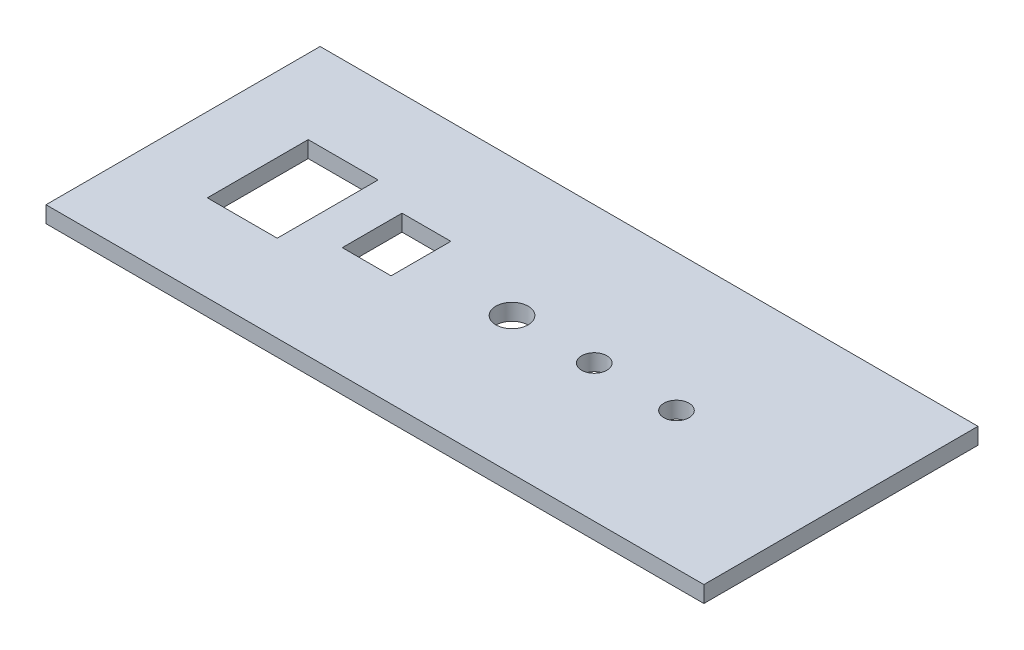
ISO-10303-21;
HEADER;
FILE_DESCRIPTION(('STEP AP214'),'2;1');
FILE_NAME('part.step','',(''),(''),'','','');
FILE_SCHEMA(('AUTOMOTIVE_DESIGN { 1 0 10303 214 1 1 1 1 }'));
ENDSEC;
DATA;
#1=APPLICATION_CONTEXT('core data for automotive mechanical design processes');
#2=APPLICATION_PROTOCOL_DEFINITION('international standard','automotive_design',2000,#1);
#3=PRODUCT_CONTEXT('',#1,'mechanical');
#4=PRODUCT('Part','Part','',(#3));
#5=PRODUCT_RELATED_PRODUCT_CATEGORY('part','',(#4));
#6=PRODUCT_DEFINITION_FORMATION('','',#4);
#7=PRODUCT_DEFINITION_CONTEXT('part definition',#1,'design');
#8=PRODUCT_DEFINITION('design','',#6,#7);
#9=PRODUCT_DEFINITION_SHAPE('','',#8);
#10=(LENGTH_UNIT() NAMED_UNIT(*) SI_UNIT(.MILLI.,.METRE.));
#11=(NAMED_UNIT(*) PLANE_ANGLE_UNIT() SI_UNIT($,.RADIAN.));
#12=(NAMED_UNIT(*) SI_UNIT($,.STERADIAN.) SOLID_ANGLE_UNIT());
#13=UNCERTAINTY_MEASURE_WITH_UNIT(LENGTH_MEASURE(1.E-05),#10,'distance_accuracy_value','');
#14=(GEOMETRIC_REPRESENTATION_CONTEXT(3) GLOBAL_UNCERTAINTY_ASSIGNED_CONTEXT((#13)) GLOBAL_UNIT_ASSIGNED_CONTEXT((#10,
#11,#12)) REPRESENTATION_CONTEXT('',''));
#15=CARTESIAN_POINT('',(0.,0.,0.));
#16=DIRECTION('',(0.,0.,1.));
#17=DIRECTION('',(1.,0.,0.));
#18=AXIS2_PLACEMENT_3D('',#15,#16,#17);
#19=CARTESIAN_POINT('',(0.,3.,0.));
#20=DIRECTION('',(-1.,0.,0.));
#21=DIRECTION('',(0.,0.,1.));
#22=AXIS2_PLACEMENT_3D('',#19,#20,#21);
#23=PLANE('',#22);
#24=DIRECTION('',(0.,0.,-1.));
#25=VECTOR('',#24,1.);
#26=CARTESIAN_POINT('',(0.,0.,0.));
#27=LINE('',#26,#25);
#28=CARTESIAN_POINT('',(0.,0.,0.));
#29=VERTEX_POINT('',#28);
#30=CARTESIAN_POINT('',(0.,0.,-50.));
#31=VERTEX_POINT('',#30);
#32=EDGE_CURVE('E197',#29,#31,#27,.T.);
#33=ORIENTED_EDGE('',*,*,#32,.T.);
#34=DIRECTION('',(0.,-1.,0.));
#35=VECTOR('',#34,1.);
#36=CARTESIAN_POINT('',(0.,3.,-50.));
#37=LINE('',#36,#35);
#38=CARTESIAN_POINT('',(0.,3.,-50.));
#39=VERTEX_POINT('',#38);
#40=EDGE_CURVE('E226',#39,#31,#37,.T.);
#41=ORIENTED_EDGE('',*,*,#40,.F.);
#42=DIRECTION('',(0.,0.,-1.));
#43=VECTOR('',#42,1.);
#44=CARTESIAN_POINT('',(0.,3.,0.));
#45=LINE('',#44,#43);
#46=CARTESIAN_POINT('',(0.,3.,0.));
#47=VERTEX_POINT('',#46);
#48=EDGE_CURVE('E200',#47,#39,#45,.T.);
#49=ORIENTED_EDGE('',*,*,#48,.F.);
#50=DIRECTION('',(0.,-1.,0.));
#51=VECTOR('',#50,1.);
#52=CARTESIAN_POINT('',(0.,3.,0.));
#53=LINE('',#52,#51);
#54=EDGE_CURVE('E210',#47,#29,#53,.T.);
#55=ORIENTED_EDGE('',*,*,#54,.T.);
#56=EDGE_LOOP('',(#33,#41,#49,#55));
#57=FACE_BOUND('',#56,.T.);
#58=ADVANCED_FACE('F33',(#57),#23,.F.);
#59=CARTESIAN_POINT('',(0.,3.,-50.));
#60=DIRECTION('',(0.,0.,1.));
#61=DIRECTION('',(1.,0.,0.));
#62=AXIS2_PLACEMENT_3D('',#59,#60,#61);
#63=PLANE('',#62);
#64=DIRECTION('',(-1.,0.,0.));
#65=VECTOR('',#64,1.);
#66=CARTESIAN_POINT('',(0.,0.,-50.));
#67=LINE('',#66,#65);
#68=CARTESIAN_POINT('',(-120.,0.,-50.));
#69=VERTEX_POINT('',#68);
#70=EDGE_CURVE('E213',#31,#69,#67,.T.);
#71=ORIENTED_EDGE('',*,*,#70,.T.);
#72=DIRECTION('',(0.,-1.,0.));
#73=VECTOR('',#72,1.);
#74=CARTESIAN_POINT('',(-120.,3.,-50.));
#75=LINE('',#74,#73);
#76=CARTESIAN_POINT('',(-120.,3.,-50.));
#77=VERTEX_POINT('',#76);
#78=EDGE_CURVE('E223',#77,#69,#75,.T.);
#79=ORIENTED_EDGE('',*,*,#78,.F.);
#80=DIRECTION('',(-1.,0.,0.));
#81=VECTOR('',#80,1.);
#82=CARTESIAN_POINT('',(0.,3.,-50.));
#83=LINE('',#82,#81);
#84=EDGE_CURVE('E203',#39,#77,#83,.T.);
#85=ORIENTED_EDGE('',*,*,#84,.F.);
#86=ORIENTED_EDGE('',*,*,#40,.T.);
#87=EDGE_LOOP('',(#71,#79,#85,#86));
#88=FACE_BOUND('',#87,.T.);
#89=ADVANCED_FACE('F253',(#88),#63,.F.);
#90=CARTESIAN_POINT('',(-120.,3.,0.));
#91=DIRECTION('',(1.,0.,0.));
#92=DIRECTION('',(0.,0.,-1.));
#93=AXIS2_PLACEMENT_3D('',#90,#91,#92);
#94=PLANE('',#93);
#95=DIRECTION('',(0.,0.,1.));
#96=VECTOR('',#95,1.);
#97=CARTESIAN_POINT('',(-120.,0.,0.));
#98=LINE('',#97,#96);
#99=CARTESIAN_POINT('',(-120.,0.,0.));
#100=VERTEX_POINT('',#99);
#101=EDGE_CURVE('E215',#69,#100,#98,.T.);
#102=ORIENTED_EDGE('',*,*,#101,.T.);
#103=DIRECTION('',(0.,-1.,0.));
#104=VECTOR('',#103,1.);
#105=CARTESIAN_POINT('',(-120.,3.,0.));
#106=LINE('',#105,#104);
#107=CARTESIAN_POINT('',(-120.,3.,0.));
#108=VERTEX_POINT('',#107);
#109=EDGE_CURVE('E220',#108,#100,#106,.T.);
#110=ORIENTED_EDGE('',*,*,#109,.F.);
#111=DIRECTION('',(0.,0.,1.));
#112=VECTOR('',#111,1.);
#113=CARTESIAN_POINT('',(-120.,3.,0.));
#114=LINE('',#113,#112);
#115=EDGE_CURVE('E206',#77,#108,#114,.T.);
#116=ORIENTED_EDGE('',*,*,#115,.F.);
#117=ORIENTED_EDGE('',*,*,#78,.T.);
#118=EDGE_LOOP('',(#102,#110,#116,#117));
#119=FACE_BOUND('',#118,.T.);
#120=ADVANCED_FACE('F258',(#119),#94,.F.);
#121=CARTESIAN_POINT('',(0.,3.,0.));
#122=DIRECTION('',(0.,0.,-1.));
#123=DIRECTION('',(-1.,0.,0.));
#124=AXIS2_PLACEMENT_3D('',#121,#122,#123);
#125=PLANE('',#124);
#126=DIRECTION('',(1.,0.,0.));
#127=VECTOR('',#126,1.);
#128=CARTESIAN_POINT('',(0.,0.,0.));
#129=LINE('',#128,#127);
#130=EDGE_CURVE('E204',#100,#29,#129,.T.);
#131=ORIENTED_EDGE('',*,*,#130,.T.);
#132=ORIENTED_EDGE('',*,*,#54,.F.);
#133=DIRECTION('',(1.,0.,0.));
#134=VECTOR('',#133,1.);
#135=CARTESIAN_POINT('',(0.,3.,0.));
#136=LINE('',#135,#134);
#137=EDGE_CURVE('E208',#108,#47,#136,.T.);
#138=ORIENTED_EDGE('',*,*,#137,.F.);
#139=ORIENTED_EDGE('',*,*,#109,.T.);
#140=EDGE_LOOP('',(#131,#132,#138,#139));
#141=FACE_BOUND('',#140,.T.);
#142=ADVANCED_FACE('F273',(#141),#125,.F.);
#143=CARTESIAN_POINT('',(0.,3.,0.));
#144=DIRECTION('',(0.,1.,0.));
#145=DIRECTION('',(0.,0.,1.));
#146=AXIS2_PLACEMENT_3D('',#143,#144,#145);
#147=PLANE('',#146);
#148=DIRECTION('',(0.,0.,1.));
#149=VECTOR('',#148,1.);
#150=CARTESIAN_POINT('',(-86.1974146204475,3.,-20.2403148805694));
#151=LINE('',#150,#149);
#152=CARTESIAN_POINT('',(-86.1974146204475,3.,-31.1403148805694));
#153=VERTEX_POINT('',#152);
#154=CARTESIAN_POINT('',(-86.1974146204475,3.,-20.2403148805694));
#155=VERTEX_POINT('',#154);
#156=EDGE_CURVE('E47',#153,#155,#151,.T.);
#157=ORIENTED_EDGE('',*,*,#156,.F.);
#158=DIRECTION('',(-1.,0.,0.));
#159=VECTOR('',#158,1.);
#160=CARTESIAN_POINT('',(-77.2974146204475,3.,-31.1403148805694));
#161=LINE('',#160,#159);
#162=CARTESIAN_POINT('',(-77.2974146204475,3.,-31.1403148805694));
#163=VERTEX_POINT('',#162);
#164=EDGE_CURVE('E140',#163,#153,#161,.T.);
#165=ORIENTED_EDGE('',*,*,#164,.F.);
#166=DIRECTION('',(0.,0.,-1.));
#167=VECTOR('',#166,1.);
#168=CARTESIAN_POINT('',(-77.2974146204475,3.,-20.2403148805694));
#169=LINE('',#168,#167);
#170=CARTESIAN_POINT('',(-77.2974146204475,3.,-20.2403148805694));
#171=VERTEX_POINT('',#170);
#172=EDGE_CURVE('E124',#171,#163,#169,.T.);
#173=ORIENTED_EDGE('',*,*,#172,.F.);
#174=DIRECTION('',(1.,0.,0.));
#175=VECTOR('',#174,1.);
#176=CARTESIAN_POINT('',(-77.2974146204475,3.,-20.2403148805694));
#177=LINE('',#176,#175);
#178=EDGE_CURVE('E133',#155,#171,#177,.T.);
#179=ORIENTED_EDGE('',*,*,#178,.F.);
#180=EDGE_LOOP('',(#157,#165,#173,#179));
#181=FACE_BOUND('',#180,.T.);
#182=DIRECTION('',(0.,0.,1.));
#183=VECTOR('',#182,1.);
#184=CARTESIAN_POINT('',(-106.375,3.,-15.8));
#185=LINE('',#184,#183);
#186=CARTESIAN_POINT('',(-106.375,3.,-34.2));
#187=VERTEX_POINT('',#186);
#188=CARTESIAN_POINT('',(-106.375,3.,-15.8));
#189=VERTEX_POINT('',#188);
#190=EDGE_CURVE('E147',#187,#189,#185,.T.);
#191=ORIENTED_EDGE('',*,*,#190,.F.);
#192=DIRECTION('',(-1.,0.,0.));
#193=VECTOR('',#192,1.);
#194=CARTESIAN_POINT('',(-93.625,3.,-34.2));
#195=LINE('',#194,#193);
#196=CARTESIAN_POINT('',(-93.625,3.,-34.2));
#197=VERTEX_POINT('',#196);
#198=EDGE_CURVE('E162',#197,#187,#195,.T.);
#199=ORIENTED_EDGE('',*,*,#198,.F.);
#200=DIRECTION('',(0.,0.,-1.));
#201=VECTOR('',#200,1.);
#202=CARTESIAN_POINT('',(-93.625,3.,-15.8));
#203=LINE('',#202,#201);
#204=CARTESIAN_POINT('',(-93.625,3.,-15.8));
#205=VERTEX_POINT('',#204);
#206=EDGE_CURVE('E176',#205,#197,#203,.T.);
#207=ORIENTED_EDGE('',*,*,#206,.F.);
#208=DIRECTION('',(1.,0.,0.));
#209=VECTOR('',#208,1.);
#210=CARTESIAN_POINT('',(-93.625,3.,-15.8));
#211=LINE('',#210,#209);
#212=EDGE_CURVE('E173',#189,#205,#211,.T.);
#213=ORIENTED_EDGE('',*,*,#212,.F.);
#214=EDGE_LOOP('',(#191,#199,#207,#213));
#215=FACE_BOUND('',#214,.T.);
#216=CARTESIAN_POINT('',(-30.,3.,-25.));
#217=DIRECTION('',(0.,1.,0.));
#218=DIRECTION('',(0.,0.,1.));
#219=AXIS2_PLACEMENT_3D('',#216,#217,#218);
#220=CIRCLE('',#219,2.3);
#221=CARTESIAN_POINT('',(-30.,3.,-22.7));
#222=VERTEX_POINT('',#221);
#223=EDGE_CURVE('E154',#222,#222,#220,.T.);
#224=ORIENTED_EDGE('',*,*,#223,.F.);
#225=EDGE_LOOP('',(#224));
#226=FACE_BOUND('',#225,.T.);
#227=CARTESIAN_POINT('',(-45.,3.,-25.));
#228=DIRECTION('',(0.,1.,0.));
#229=DIRECTION('',(0.,0.,1.));
#230=AXIS2_PLACEMENT_3D('',#227,#228,#229);
#231=CIRCLE('',#230,2.3);
#232=CARTESIAN_POINT('',(-45.,3.,-22.7));
#233=VERTEX_POINT('',#232);
#234=EDGE_CURVE('E153',#233,#233,#231,.T.);
#235=ORIENTED_EDGE('',*,*,#234,.F.);
#236=EDGE_LOOP('',(#235));
#237=FACE_BOUND('',#236,.T.);
#238=CARTESIAN_POINT('',(-60.,3.,-25.));
#239=DIRECTION('',(0.,1.,0.));
#240=DIRECTION('',(0.,0.,1.));
#241=AXIS2_PLACEMENT_3D('',#238,#239,#240);
#242=CIRCLE('',#241,2.95);
#243=CARTESIAN_POINT('',(-60.,3.,-22.05));
#244=VERTEX_POINT('',#243);
#245=EDGE_CURVE('E191',#244,#244,#242,.T.);
#246=ORIENTED_EDGE('',*,*,#245,.F.);
#247=EDGE_LOOP('',(#246));
#248=FACE_BOUND('',#247,.T.);
#249=ORIENTED_EDGE('',*,*,#48,.T.);
#250=ORIENTED_EDGE('',*,*,#84,.T.);
#251=ORIENTED_EDGE('',*,*,#115,.T.);
#252=ORIENTED_EDGE('',*,*,#137,.T.);
#253=EDGE_LOOP('',(#249,#250,#251,#252));
#254=FACE_BOUND('',#253,.T.);
#255=ADVANCED_FACE('F137',(#181,#215,#226,#237,#248,#254),#147,.T.);
#256=CARTESIAN_POINT('',(0.,0.,0.));
#257=DIRECTION('',(0.,1.,0.));
#258=DIRECTION('',(0.,0.,1.));
#259=AXIS2_PLACEMENT_3D('',#256,#257,#258);
#260=PLANE('',#259);
#261=DIRECTION('',(-1.,0.,0.));
#262=VECTOR('',#261,1.);
#263=CARTESIAN_POINT('',(0.,0.,-31.1403148805694));
#264=LINE('',#263,#262);
#265=CARTESIAN_POINT('',(-77.2974146204475,0.,-31.1403148805694));
#266=VERTEX_POINT('',#265);
#267=CARTESIAN_POINT('',(-86.1974146204475,0.,-31.1403148805694));
#268=VERTEX_POINT('',#267);
#269=EDGE_CURVE('E40',#266,#268,#264,.T.);
#270=ORIENTED_EDGE('',*,*,#269,.T.);
#271=DIRECTION('',(0.,0.,1.));
#272=VECTOR('',#271,1.);
#273=CARTESIAN_POINT('',(-86.1974146204475,0.,0.));
#274=LINE('',#273,#272);
#275=CARTESIAN_POINT('',(-86.1974146204475,0.,-20.2403148805694));
#276=VERTEX_POINT('',#275);
#277=EDGE_CURVE('E11',#268,#276,#274,.T.);
#278=ORIENTED_EDGE('',*,*,#277,.T.);
#279=DIRECTION('',(1.,0.,0.));
#280=VECTOR('',#279,1.);
#281=CARTESIAN_POINT('',(0.,0.,-20.2403148805694));
#282=LINE('',#281,#280);
#283=CARTESIAN_POINT('',(-77.2974146204475,0.,-20.2403148805694));
#284=VERTEX_POINT('',#283);
#285=EDGE_CURVE('E229',#276,#284,#282,.T.);
#286=ORIENTED_EDGE('',*,*,#285,.T.);
#287=DIRECTION('',(0.,0.,-1.));
#288=VECTOR('',#287,1.);
#289=CARTESIAN_POINT('',(-77.2974146204475,0.,0.));
#290=LINE('',#289,#288);
#291=EDGE_CURVE('E127',#284,#266,#290,.T.);
#292=ORIENTED_EDGE('',*,*,#291,.T.);
#293=EDGE_LOOP('',(#270,#278,#286,#292));
#294=FACE_BOUND('',#293,.T.);
#295=DIRECTION('',(-1.,0.,0.));
#296=VECTOR('',#295,1.);
#297=CARTESIAN_POINT('',(-93.625,0.,-34.2));
#298=LINE('',#297,#296);
#299=CARTESIAN_POINT('',(-93.625,0.,-34.2));
#300=VERTEX_POINT('',#299);
#301=CARTESIAN_POINT('',(-106.375,0.,-34.2));
#302=VERTEX_POINT('',#301);
#303=EDGE_CURVE('E168',#300,#302,#298,.T.);
#304=ORIENTED_EDGE('',*,*,#303,.T.);
#305=DIRECTION('',(0.,0.,1.));
#306=VECTOR('',#305,1.);
#307=CARTESIAN_POINT('',(-106.375,0.,-15.8));
#308=LINE('',#307,#306);
#309=CARTESIAN_POINT('',(-106.375,0.,-15.8));
#310=VERTEX_POINT('',#309);
#311=EDGE_CURVE('E158',#302,#310,#308,.T.);
#312=ORIENTED_EDGE('',*,*,#311,.T.);
#313=DIRECTION('',(1.,0.,0.));
#314=VECTOR('',#313,1.);
#315=CARTESIAN_POINT('',(-93.625,0.,-15.8));
#316=LINE('',#315,#314);
#317=CARTESIAN_POINT('',(-93.625,0.,-15.8));
#318=VERTEX_POINT('',#317);
#319=EDGE_CURVE('E161',#310,#318,#316,.T.);
#320=ORIENTED_EDGE('',*,*,#319,.T.);
#321=DIRECTION('',(0.,0.,-1.));
#322=VECTOR('',#321,1.);
#323=CARTESIAN_POINT('',(-93.625,0.,-15.8));
#324=LINE('',#323,#322);
#325=EDGE_CURVE('E165',#318,#300,#324,.T.);
#326=ORIENTED_EDGE('',*,*,#325,.T.);
#327=EDGE_LOOP('',(#304,#312,#320,#326));
#328=FACE_BOUND('',#327,.T.);
#329=CARTESIAN_POINT('',(-30.,0.,-25.));
#330=DIRECTION('',(0.,1.,0.));
#331=DIRECTION('',(0.,0.,1.));
#332=AXIS2_PLACEMENT_3D('',#329,#330,#331);
#333=CIRCLE('',#332,2.3);
#334=CARTESIAN_POINT('',(-30.,0.,-22.7));
#335=VERTEX_POINT('',#334);
#336=EDGE_CURVE('E150',#335,#335,#333,.T.);
#337=ORIENTED_EDGE('',*,*,#336,.T.);
#338=EDGE_LOOP('',(#337));
#339=FACE_BOUND('',#338,.T.);
#340=CARTESIAN_POINT('',(-45.,0.,-25.));
#341=DIRECTION('',(0.,1.,0.));
#342=DIRECTION('',(0.,0.,1.));
#343=AXIS2_PLACEMENT_3D('',#340,#341,#342);
#344=CIRCLE('',#343,2.3);
#345=CARTESIAN_POINT('',(-45.,0.,-22.7));
#346=VERTEX_POINT('',#345);
#347=EDGE_CURVE('E188',#346,#346,#344,.T.);
#348=ORIENTED_EDGE('',*,*,#347,.T.);
#349=EDGE_LOOP('',(#348));
#350=FACE_BOUND('',#349,.T.);
#351=CARTESIAN_POINT('',(-60.,0.,-25.));
#352=DIRECTION('',(0.,1.,0.));
#353=DIRECTION('',(0.,0.,1.));
#354=AXIS2_PLACEMENT_3D('',#351,#352,#353);
#355=CIRCLE('',#354,2.95);
#356=CARTESIAN_POINT('',(-60.,0.,-22.05));
#357=VERTEX_POINT('',#356);
#358=EDGE_CURVE('E194',#357,#357,#355,.T.);
#359=ORIENTED_EDGE('',*,*,#358,.T.);
#360=EDGE_LOOP('',(#359));
#361=FACE_BOUND('',#360,.T.);
#362=ORIENTED_EDGE('',*,*,#32,.F.);
#363=ORIENTED_EDGE('',*,*,#130,.F.);
#364=ORIENTED_EDGE('',*,*,#101,.F.);
#365=ORIENTED_EDGE('',*,*,#70,.F.);
#366=EDGE_LOOP('',(#362,#363,#364,#365));
#367=FACE_BOUND('',#366,.T.);
#368=ADVANCED_FACE('F233',(#294,#328,#339,#350,#361,#367),#260,.F.);
#369=CARTESIAN_POINT('',(-60.,0.,-25.));
#370=DIRECTION('',(0.,1.,0.));
#371=DIRECTION('',(0.,0.,1.));
#372=AXIS2_PLACEMENT_3D('',#369,#370,#371);
#373=CYLINDRICAL_SURFACE('',#372,2.95);
#374=ORIENTED_EDGE('',*,*,#358,.F.);
#375=EDGE_LOOP('',(#374));
#376=FACE_BOUND('',#375,.T.);
#377=ORIENTED_EDGE('',*,*,#245,.T.);
#378=EDGE_LOOP('',(#377));
#379=FACE_BOUND('',#378,.T.);
#380=ADVANCED_FACE('F284',(#376,#379),#373,.F.);
#381=CARTESIAN_POINT('',(-45.,0.,-25.));
#382=DIRECTION('',(0.,1.,0.));
#383=DIRECTION('',(0.,0.,1.));
#384=AXIS2_PLACEMENT_3D('',#381,#382,#383);
#385=CYLINDRICAL_SURFACE('',#384,2.3);
#386=ORIENTED_EDGE('',*,*,#347,.F.);
#387=EDGE_LOOP('',(#386));
#388=FACE_BOUND('',#387,.T.);
#389=ORIENTED_EDGE('',*,*,#234,.T.);
#390=EDGE_LOOP('',(#389));
#391=FACE_BOUND('',#390,.T.);
#392=ADVANCED_FACE('F289',(#388,#391),#385,.F.);
#393=CARTESIAN_POINT('',(-30.,0.,-25.));
#394=DIRECTION('',(0.,1.,0.));
#395=DIRECTION('',(0.,0.,1.));
#396=AXIS2_PLACEMENT_3D('',#393,#394,#395);
#397=CYLINDRICAL_SURFACE('',#396,2.3);
#398=ORIENTED_EDGE('',*,*,#336,.F.);
#399=EDGE_LOOP('',(#398));
#400=FACE_BOUND('',#399,.T.);
#401=ORIENTED_EDGE('',*,*,#223,.T.);
#402=EDGE_LOOP('',(#401));
#403=FACE_BOUND('',#402,.T.);
#404=ADVANCED_FACE('F293',(#400,#403),#397,.F.);
#405=CARTESIAN_POINT('',(-106.375,0.,-15.8));
#406=DIRECTION('',(-1.,0.,0.));
#407=DIRECTION('',(0.,0.,1.));
#408=AXIS2_PLACEMENT_3D('',#405,#406,#407);
#409=PLANE('',#408);
#410=ORIENTED_EDGE('',*,*,#190,.T.);
#411=DIRECTION('',(0.,1.,0.));
#412=VECTOR('',#411,1.);
#413=CARTESIAN_POINT('',(-106.375,0.,-15.8));
#414=LINE('',#413,#412);
#415=EDGE_CURVE('E171',#310,#189,#414,.T.);
#416=ORIENTED_EDGE('',*,*,#415,.F.);
#417=ORIENTED_EDGE('',*,*,#311,.F.);
#418=DIRECTION('',(0.,1.,0.));
#419=VECTOR('',#418,1.);
#420=CARTESIAN_POINT('',(-106.375,0.,-34.2));
#421=LINE('',#420,#419);
#422=EDGE_CURVE('E157',#302,#187,#421,.T.);
#423=ORIENTED_EDGE('',*,*,#422,.T.);
#424=EDGE_LOOP('',(#410,#416,#417,#423));
#425=FACE_BOUND('',#424,.T.);
#426=ADVANCED_FACE('F295',(#425),#409,.F.);
#427=CARTESIAN_POINT('',(-93.625,0.,-34.2));
#428=DIRECTION('',(0.,0.,-1.));
#429=DIRECTION('',(-1.,0.,0.));
#430=AXIS2_PLACEMENT_3D('',#427,#428,#429);
#431=PLANE('',#430);
#432=ORIENTED_EDGE('',*,*,#198,.T.);
#433=ORIENTED_EDGE('',*,*,#422,.F.);
#434=ORIENTED_EDGE('',*,*,#303,.F.);
#435=DIRECTION('',(0.,1.,0.));
#436=VECTOR('',#435,1.);
#437=CARTESIAN_POINT('',(-93.625,0.,-34.2));
#438=LINE('',#437,#436);
#439=EDGE_CURVE('E182',#300,#197,#438,.T.);
#440=ORIENTED_EDGE('',*,*,#439,.T.);
#441=EDGE_LOOP('',(#432,#433,#434,#440));
#442=FACE_BOUND('',#441,.T.);
#443=ADVANCED_FACE('F297',(#442),#431,.F.);
#444=CARTESIAN_POINT('',(-93.625,0.,-15.8));
#445=DIRECTION('',(1.,0.,0.));
#446=DIRECTION('',(0.,0.,-1.));
#447=AXIS2_PLACEMENT_3D('',#444,#445,#446);
#448=PLANE('',#447);
#449=ORIENTED_EDGE('',*,*,#206,.T.);
#450=ORIENTED_EDGE('',*,*,#439,.F.);
#451=ORIENTED_EDGE('',*,*,#325,.F.);
#452=DIRECTION('',(0.,1.,0.));
#453=VECTOR('',#452,1.);
#454=CARTESIAN_POINT('',(-93.625,0.,-15.8));
#455=LINE('',#454,#453);
#456=EDGE_CURVE('E184',#318,#205,#455,.T.);
#457=ORIENTED_EDGE('',*,*,#456,.T.);
#458=EDGE_LOOP('',(#449,#450,#451,#457));
#459=FACE_BOUND('',#458,.T.);
#460=ADVANCED_FACE('F247',(#459),#448,.F.);
#461=CARTESIAN_POINT('',(-93.625,0.,-15.8));
#462=DIRECTION('',(0.,0.,1.));
#463=DIRECTION('',(1.,0.,0.));
#464=AXIS2_PLACEMENT_3D('',#461,#462,#463);
#465=PLANE('',#464);
#466=ORIENTED_EDGE('',*,*,#212,.T.);
#467=ORIENTED_EDGE('',*,*,#456,.F.);
#468=ORIENTED_EDGE('',*,*,#319,.F.);
#469=ORIENTED_EDGE('',*,*,#415,.T.);
#470=EDGE_LOOP('',(#466,#467,#468,#469));
#471=FACE_BOUND('',#470,.T.);
#472=ADVANCED_FACE('F240',(#471),#465,.F.);
#473=CARTESIAN_POINT('',(-86.1974146204475,-7.,-20.2403148805694));
#474=DIRECTION('',(-1.,0.,0.));
#475=DIRECTION('',(0.,0.,1.));
#476=AXIS2_PLACEMENT_3D('',#473,#474,#475);
#477=PLANE('',#476);
#478=DIRECTION('',(0.,1.,0.));
#479=VECTOR('',#478,1.);
#480=CARTESIAN_POINT('',(-86.1974146204475,-7.,-31.1403148805694));
#481=LINE('',#480,#479);
#482=EDGE_CURVE('E145',#268,#153,#481,.T.);
#483=ORIENTED_EDGE('',*,*,#482,.T.);
#484=ORIENTED_EDGE('',*,*,#156,.T.);
#485=DIRECTION('',(0.,1.,0.));
#486=VECTOR('',#485,1.);
#487=CARTESIAN_POINT('',(-86.1974146204475,-7.,-20.2403148805694));
#488=LINE('',#487,#486);
#489=EDGE_CURVE('E130',#276,#155,#488,.T.);
#490=ORIENTED_EDGE('',*,*,#489,.F.);
#491=ORIENTED_EDGE('',*,*,#277,.F.);
#492=EDGE_LOOP('',(#483,#484,#490,#491));
#493=FACE_BOUND('',#492,.T.);
#494=ADVANCED_FACE('F238',(#493),#477,.F.);
#495=CARTESIAN_POINT('',(-77.2974146204475,-7.,-31.1403148805694));
#496=DIRECTION('',(0.,0.,-1.));
#497=DIRECTION('',(-1.,0.,0.));
#498=AXIS2_PLACEMENT_3D('',#495,#496,#497);
#499=PLANE('',#498);
#500=DIRECTION('',(0.,1.,0.));
#501=VECTOR('',#500,1.);
#502=CARTESIAN_POINT('',(-77.2974146204475,-7.,-31.1403148805694));
#503=LINE('',#502,#501);
#504=EDGE_CURVE('E129',#266,#163,#503,.T.);
#505=ORIENTED_EDGE('',*,*,#504,.T.);
#506=ORIENTED_EDGE('',*,*,#164,.T.);
#507=ORIENTED_EDGE('',*,*,#482,.F.);
#508=ORIENTED_EDGE('',*,*,#269,.F.);
#509=EDGE_LOOP('',(#505,#506,#507,#508));
#510=FACE_BOUND('',#509,.T.);
#511=ADVANCED_FACE('F237',(#510),#499,.F.);
#512=CARTESIAN_POINT('',(-77.2974146204475,-7.,-20.2403148805694));
#513=DIRECTION('',(1.,0.,0.));
#514=DIRECTION('',(0.,0.,-1.));
#515=AXIS2_PLACEMENT_3D('',#512,#513,#514);
#516=PLANE('',#515);
#517=DIRECTION('',(0.,1.,0.));
#518=VECTOR('',#517,1.);
#519=CARTESIAN_POINT('',(-77.2974146204475,-7.,-20.2403148805694));
#520=LINE('',#519,#518);
#521=EDGE_CURVE('E55',#284,#171,#520,.T.);
#522=ORIENTED_EDGE('',*,*,#521,.T.);
#523=ORIENTED_EDGE('',*,*,#172,.T.);
#524=ORIENTED_EDGE('',*,*,#504,.F.);
#525=ORIENTED_EDGE('',*,*,#291,.F.);
#526=EDGE_LOOP('',(#522,#523,#524,#525));
#527=FACE_BOUND('',#526,.T.);
#528=ADVANCED_FACE('F121',(#527),#516,.F.);
#529=CARTESIAN_POINT('',(-77.2974146204475,-7.,-20.2403148805694));
#530=DIRECTION('',(0.,0.,1.));
#531=DIRECTION('',(1.,0.,0.));
#532=AXIS2_PLACEMENT_3D('',#529,#530,#531);
#533=PLANE('',#532);
#534=ORIENTED_EDGE('',*,*,#489,.T.);
#535=ORIENTED_EDGE('',*,*,#178,.T.);
#536=ORIENTED_EDGE('',*,*,#521,.F.);
#537=ORIENTED_EDGE('',*,*,#285,.F.);
#538=EDGE_LOOP('',(#534,#535,#536,#537));
#539=FACE_BOUND('',#538,.T.);
#540=ADVANCED_FACE('F134',(#539),#533,.F.);
#541=CLOSED_SHELL('',(#58,#89,#120,#142,#255,#368,#380,#392,#404,#426,#443,#460,#472,#494,#511,
#528,#540));
#542=MANIFOLD_SOLID_BREP('B2',#541);
#543=ADVANCED_BREP_SHAPE_REPRESENTATION('',(#18,#542),#14);
#544=SHAPE_DEFINITION_REPRESENTATION(#9,#543);
ENDSEC;
END-ISO-10303-21;
